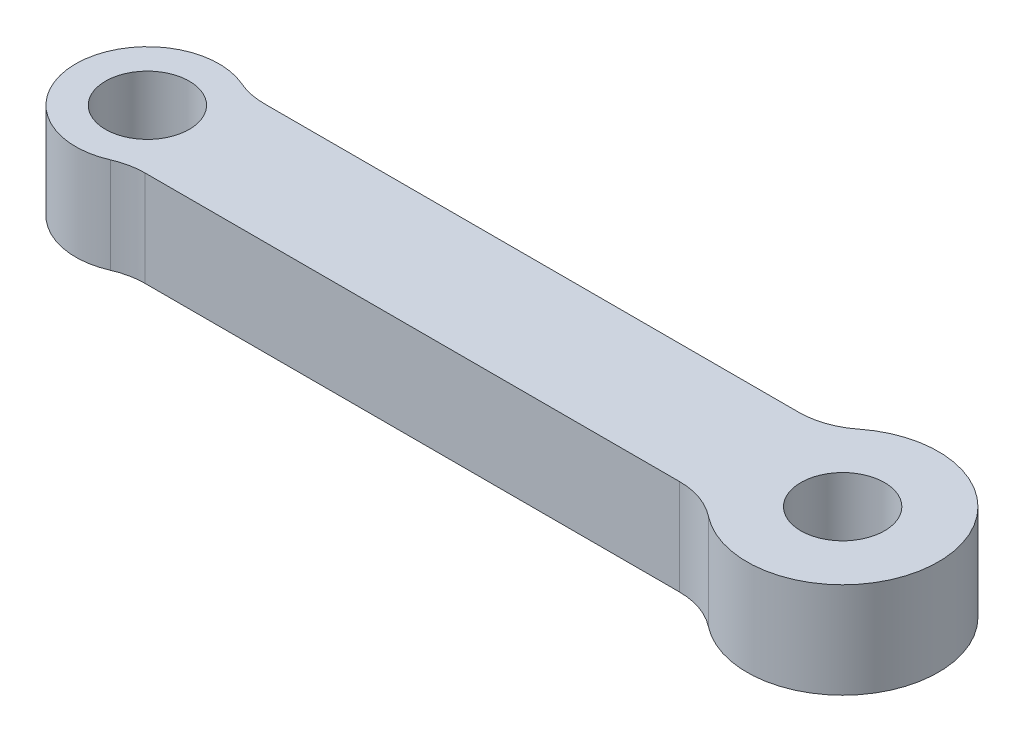
ISO-10303-21;
HEADER;
FILE_DESCRIPTION(('STEP AP214'),'2;1');
FILE_NAME('part.step','',(''),(''),'','','');
FILE_SCHEMA(('AUTOMOTIVE_DESIGN { 1 0 10303 214 1 1 1 1 }'));
ENDSEC;
DATA;
#1=APPLICATION_CONTEXT('core data for automotive mechanical design processes');
#2=APPLICATION_PROTOCOL_DEFINITION('international standard','automotive_design',2000,#1);
#3=PRODUCT_CONTEXT('',#1,'mechanical');
#4=PRODUCT('Part','Part','',(#3));
#5=PRODUCT_RELATED_PRODUCT_CATEGORY('part','',(#4));
#6=PRODUCT_DEFINITION_FORMATION('','',#4);
#7=PRODUCT_DEFINITION_CONTEXT('part definition',#1,'design');
#8=PRODUCT_DEFINITION('design','',#6,#7);
#9=PRODUCT_DEFINITION_SHAPE('','',#8);
#10=(LENGTH_UNIT() NAMED_UNIT(*) SI_UNIT(.MILLI.,.METRE.));
#11=(NAMED_UNIT(*) PLANE_ANGLE_UNIT() SI_UNIT($,.RADIAN.));
#12=(NAMED_UNIT(*) SI_UNIT($,.STERADIAN.) SOLID_ANGLE_UNIT());
#13=UNCERTAINTY_MEASURE_WITH_UNIT(LENGTH_MEASURE(1.E-05),#10,'distance_accuracy_value','');
#14=(GEOMETRIC_REPRESENTATION_CONTEXT(3) GLOBAL_UNCERTAINTY_ASSIGNED_CONTEXT((#13)) GLOBAL_UNIT_ASSIGNED_CONTEXT((#10,
#11,#12)) REPRESENTATION_CONTEXT('',''));
#15=CARTESIAN_POINT('',(0.,0.,0.));
#16=DIRECTION('',(0.,0.,1.));
#17=DIRECTION('',(1.,0.,0.));
#18=AXIS2_PLACEMENT_3D('',#15,#16,#17);
#19=CARTESIAN_POINT('',(11.17,4.,5.5));
#20=DIRECTION('',(0.,-1.,0.));
#21=DIRECTION('',(0.,0.,-1.));
#22=AXIS2_PLACEMENT_3D('',#19,#20,#21);
#23=PLANE('',#22);
#24=CARTESIAN_POINT('',(-13.5679157616564,4.,0.));
#25=DIRECTION('',(0.,1.,0.));
#26=DIRECTION('',(0.,0.,1.));
#27=AXIS2_PLACEMENT_3D('',#24,#25,#26);
#28=CIRCLE('',#27,1.75);
#29=CARTESIAN_POINT('',(-13.5679157616564,4.,1.75));
#30=VERTEX_POINT('',#29);
#31=EDGE_CURVE('E135',#30,#30,#28,.T.);
#32=ORIENTED_EDGE('',*,*,#31,.F.);
#33=EDGE_LOOP('',(#32));
#34=FACE_BOUND('',#33,.T.);
#35=CARTESIAN_POINT('',(11.17,4.,5.5));
#36=DIRECTION('',(0.,-1.,0.));
#37=DIRECTION('',(0.,0.,-1.));
#38=AXIS2_PLACEMENT_3D('',#35,#36,#37);
#39=CIRCLE('',#38,3.);
#40=CARTESIAN_POINT('',(11.17,4.,2.5));
#41=VERTEX_POINT('',#40);
#42=CARTESIAN_POINT('',(13.0257687223952,4.,3.14285714285714));
#43=VERTEX_POINT('',#42);
#44=EDGE_CURVE('E148',#41,#43,#39,.T.);
#45=ORIENTED_EDGE('',*,*,#44,.T.);
#46=CARTESIAN_POINT('',(15.5001270189222,4.,0.));
#47=DIRECTION('',(0.,1.,0.));
#48=DIRECTION('',(0.,0.,1.));
#49=AXIS2_PLACEMENT_3D('',#46,#47,#48);
#50=CIRCLE('',#49,4.);
#51=CARTESIAN_POINT('',(13.0257687223952,4.,-3.14285714285714));
#52=VERTEX_POINT('',#51);
#53=EDGE_CURVE('E91',#43,#52,#50,.T.);
#54=ORIENTED_EDGE('',*,*,#53,.T.);
#55=CARTESIAN_POINT('',(11.17,4.,-5.5));
#56=DIRECTION('',(0.,-1.,0.));
#57=DIRECTION('',(0.,0.,1.));
#58=AXIS2_PLACEMENT_3D('',#55,#56,#57);
#59=CIRCLE('',#58,3.);
#60=CARTESIAN_POINT('',(11.17,4.,-2.5));
#61=VERTEX_POINT('',#60);
#62=EDGE_CURVE('E163',#52,#61,#59,.T.);
#63=ORIENTED_EDGE('',*,*,#62,.T.);
#64=DIRECTION('',(-1.,0.,0.));
#65=VECTOR('',#64,1.);
#66=CARTESIAN_POINT('',(4.07110647886474,4.,-2.5));
#67=LINE('',#66,#65);
#68=CARTESIAN_POINT('',(-11.17,4.,-2.5));
#69=VERTEX_POINT('',#68);
#70=EDGE_CURVE('E173',#61,#69,#67,.T.);
#71=ORIENTED_EDGE('',*,*,#70,.T.);
#72=CARTESIAN_POINT('',(-11.17,4.,-5.5));
#73=DIRECTION('',(0.,-1.,0.));
#74=DIRECTION('',(0.,0.,-1.));
#75=AXIS2_PLACEMENT_3D('',#72,#73,#74);
#76=CIRCLE('',#75,3.);
#77=CARTESIAN_POINT('',(-12.3689578808282,4.,-2.75));
#78=VERTEX_POINT('',#77);
#79=EDGE_CURVE('E111',#69,#78,#76,.T.);
#80=ORIENTED_EDGE('',*,*,#79,.T.);
#81=CARTESIAN_POINT('',(-13.5679157616564,4.,0.));
#82=DIRECTION('',(0.,1.,0.));
#83=DIRECTION('',(0.,0.,1.));
#84=AXIS2_PLACEMENT_3D('',#81,#82,#83);
#85=CIRCLE('',#84,3.);
#86=CARTESIAN_POINT('',(-12.3689578808282,4.,2.75));
#87=VERTEX_POINT('',#86);
#88=EDGE_CURVE('E104',#78,#87,#85,.T.);
#89=ORIENTED_EDGE('',*,*,#88,.T.);
#90=CARTESIAN_POINT('',(-11.17,4.,5.5));
#91=DIRECTION('',(0.,-1.,0.));
#92=DIRECTION('',(0.,0.,-1.));
#93=AXIS2_PLACEMENT_3D('',#90,#91,#92);
#94=CIRCLE('',#93,3.);
#95=CARTESIAN_POINT('',(-11.17,4.,2.5));
#96=VERTEX_POINT('',#95);
#97=EDGE_CURVE('E108',#87,#96,#94,.T.);
#98=ORIENTED_EDGE('',*,*,#97,.T.);
#99=DIRECTION('',(1.,0.,0.));
#100=VECTOR('',#99,1.);
#101=CARTESIAN_POINT('',(-10.2186534112875,4.,2.5));
#102=LINE('',#101,#100);
#103=EDGE_CURVE('E50',#96,#41,#102,.T.);
#104=ORIENTED_EDGE('',*,*,#103,.T.);
#105=EDGE_LOOP('',(#45,#54,#63,#71,#80,#89,#98,#104));
#106=FACE_BOUND('',#105,.T.);
#107=CARTESIAN_POINT('',(15.5001270189222,4.,0.));
#108=DIRECTION('',(0.,1.,0.));
#109=DIRECTION('',(0.,0.,1.));
#110=AXIS2_PLACEMENT_3D('',#107,#108,#109);
#111=CIRCLE('',#110,1.75);
#112=CARTESIAN_POINT('',(15.5001270189222,4.,1.75));
#113=VERTEX_POINT('',#112);
#114=EDGE_CURVE('E182',#113,#113,#111,.T.);
#115=ORIENTED_EDGE('',*,*,#114,.F.);
#116=EDGE_LOOP('',(#115));
#117=FACE_BOUND('',#116,.T.);
#118=ADVANCED_FACE('F33',(#34,#106,#117),#23,.F.);
#119=CARTESIAN_POINT('',(11.17,0.,5.5));
#120=DIRECTION('',(0.,-1.,0.));
#121=DIRECTION('',(0.,0.,-1.));
#122=AXIS2_PLACEMENT_3D('',#119,#120,#121);
#123=PLANE('',#122);
#124=CARTESIAN_POINT('',(-13.5679157616564,0.,0.));
#125=DIRECTION('',(0.,1.,0.));
#126=DIRECTION('',(0.,0.,1.));
#127=AXIS2_PLACEMENT_3D('',#124,#125,#126);
#128=CIRCLE('',#127,1.75);
#129=CARTESIAN_POINT('',(-13.5679157616564,0.,1.75));
#130=VERTEX_POINT('',#129);
#131=EDGE_CURVE('E179',#130,#130,#128,.T.);
#132=ORIENTED_EDGE('',*,*,#131,.T.);
#133=EDGE_LOOP('',(#132));
#134=FACE_BOUND('',#133,.T.);
#135=CARTESIAN_POINT('',(11.17,0.,5.5));
#136=DIRECTION('',(0.,-1.,0.));
#137=DIRECTION('',(0.,0.,-1.));
#138=AXIS2_PLACEMENT_3D('',#135,#136,#137);
#139=CIRCLE('',#138,3.);
#140=CARTESIAN_POINT('',(11.17,0.,2.5));
#141=VERTEX_POINT('',#140);
#142=CARTESIAN_POINT('',(13.0257687223952,0.,3.14285714285714));
#143=VERTEX_POINT('',#142);
#144=EDGE_CURVE('E131',#141,#143,#139,.T.);
#145=ORIENTED_EDGE('',*,*,#144,.F.);
#146=DIRECTION('',(1.,0.,0.));
#147=VECTOR('',#146,1.);
#148=CARTESIAN_POINT('',(4.07110647886474,0.,2.5));
#149=LINE('',#148,#147);
#150=CARTESIAN_POINT('',(-11.17,0.,2.5));
#151=VERTEX_POINT('',#150);
#152=EDGE_CURVE('E79',#151,#141,#149,.T.);
#153=ORIENTED_EDGE('',*,*,#152,.F.);
#154=CARTESIAN_POINT('',(-11.17,0.,5.5));
#155=DIRECTION('',(0.,-1.,0.));
#156=DIRECTION('',(0.,0.,-1.));
#157=AXIS2_PLACEMENT_3D('',#154,#155,#156);
#158=CIRCLE('',#157,3.);
#159=CARTESIAN_POINT('',(-12.3689578808282,0.,2.75));
#160=VERTEX_POINT('',#159);
#161=EDGE_CURVE('E145',#160,#151,#158,.T.);
#162=ORIENTED_EDGE('',*,*,#161,.F.);
#163=CARTESIAN_POINT('',(-13.5679157616564,0.,0.));
#164=DIRECTION('',(0.,1.,0.));
#165=DIRECTION('',(0.,0.,1.));
#166=AXIS2_PLACEMENT_3D('',#163,#164,#165);
#167=CIRCLE('',#166,3.);
#168=CARTESIAN_POINT('',(-12.3689578808282,0.,-2.75));
#169=VERTEX_POINT('',#168);
#170=EDGE_CURVE('E120',#169,#160,#167,.T.);
#171=ORIENTED_EDGE('',*,*,#170,.F.);
#172=CARTESIAN_POINT('',(-11.17,0.,-5.5));
#173=DIRECTION('',(0.,-1.,0.));
#174=DIRECTION('',(0.,0.,-1.));
#175=AXIS2_PLACEMENT_3D('',#172,#173,#174);
#176=CIRCLE('',#175,3.);
#177=CARTESIAN_POINT('',(-11.17,0.,-2.5));
#178=VERTEX_POINT('',#177);
#179=EDGE_CURVE('E142',#178,#169,#176,.T.);
#180=ORIENTED_EDGE('',*,*,#179,.F.);
#181=DIRECTION('',(-1.,0.,0.));
#182=VECTOR('',#181,1.);
#183=CARTESIAN_POINT('',(-10.2186534112875,0.,-2.5));
#184=LINE('',#183,#182);
#185=CARTESIAN_POINT('',(11.17,0.,-2.5));
#186=VERTEX_POINT('',#185);
#187=EDGE_CURVE('E140',#186,#178,#184,.T.);
#188=ORIENTED_EDGE('',*,*,#187,.F.);
#189=CARTESIAN_POINT('',(11.17,0.,-5.5));
#190=DIRECTION('',(0.,-1.,0.));
#191=DIRECTION('',(0.,0.,1.));
#192=AXIS2_PLACEMENT_3D('',#189,#190,#191);
#193=CIRCLE('',#192,3.);
#194=CARTESIAN_POINT('',(13.0257687223952,0.,-3.14285714285714));
#195=VERTEX_POINT('',#194);
#196=EDGE_CURVE('E137',#195,#186,#193,.T.);
#197=ORIENTED_EDGE('',*,*,#196,.F.);
#198=CARTESIAN_POINT('',(15.5001270189222,0.,0.));
#199=DIRECTION('',(0.,1.,0.));
#200=DIRECTION('',(0.,0.,1.));
#201=AXIS2_PLACEMENT_3D('',#198,#199,#200);
#202=CIRCLE('',#201,4.);
#203=EDGE_CURVE('E134',#143,#195,#202,.T.);
#204=ORIENTED_EDGE('',*,*,#203,.F.);
#205=EDGE_LOOP('',(#145,#153,#162,#171,#180,#188,#197,#204));
#206=FACE_BOUND('',#205,.T.);
#207=CARTESIAN_POINT('',(15.5001270189222,0.,0.));
#208=DIRECTION('',(0.,1.,0.));
#209=DIRECTION('',(0.,0.,1.));
#210=AXIS2_PLACEMENT_3D('',#207,#208,#209);
#211=CIRCLE('',#210,1.75);
#212=CARTESIAN_POINT('',(15.5001270189222,0.,1.75));
#213=VERTEX_POINT('',#212);
#214=EDGE_CURVE('E185',#213,#213,#211,.T.);
#215=ORIENTED_EDGE('',*,*,#214,.T.);
#216=EDGE_LOOP('',(#215));
#217=FACE_BOUND('',#216,.T.);
#218=ADVANCED_FACE('F164',(#134,#206,#217),#123,.T.);
#219=CARTESIAN_POINT('',(11.17,4.,5.5));
#220=DIRECTION('',(0.,-1.,0.));
#221=DIRECTION('',(0.,0.,-1.));
#222=AXIS2_PLACEMENT_3D('',#219,#220,#221);
#223=CYLINDRICAL_SURFACE('',#222,3.);
#224=ORIENTED_EDGE('',*,*,#144,.T.);
#225=DIRECTION('',(0.,-1.,0.));
#226=VECTOR('',#225,1.);
#227=CARTESIAN_POINT('',(13.0257687223952,4.,3.14285714285714));
#228=LINE('',#227,#226);
#229=EDGE_CURVE('E11',#43,#143,#228,.T.);
#230=ORIENTED_EDGE('',*,*,#229,.F.);
#231=ORIENTED_EDGE('',*,*,#44,.F.);
#232=DIRECTION('',(0.,-1.,0.));
#233=VECTOR('',#232,1.);
#234=CARTESIAN_POINT('',(11.17,4.,2.5));
#235=LINE('',#234,#233);
#236=EDGE_CURVE('E127',#41,#141,#235,.T.);
#237=ORIENTED_EDGE('',*,*,#236,.T.);
#238=EDGE_LOOP('',(#224,#230,#231,#237));
#239=FACE_BOUND('',#238,.T.);
#240=ADVANCED_FACE('F35',(#239),#223,.F.);
#241=CARTESIAN_POINT('',(15.5001270189222,4.,0.));
#242=DIRECTION('',(0.,-1.,0.));
#243=DIRECTION('',(0.,0.,-1.));
#244=AXIS2_PLACEMENT_3D('',#241,#242,#243);
#245=CYLINDRICAL_SURFACE('',#244,4.);
#246=ORIENTED_EDGE('',*,*,#203,.T.);
#247=DIRECTION('',(0.,-1.,0.));
#248=VECTOR('',#247,1.);
#249=CARTESIAN_POINT('',(13.0257687223952,4.,-3.14285714285714));
#250=LINE('',#249,#248);
#251=EDGE_CURVE('E42',#52,#195,#250,.T.);
#252=ORIENTED_EDGE('',*,*,#251,.F.);
#253=ORIENTED_EDGE('',*,*,#53,.F.);
#254=ORIENTED_EDGE('',*,*,#229,.T.);
#255=EDGE_LOOP('',(#246,#252,#253,#254));
#256=FACE_BOUND('',#255,.T.);
#257=ADVANCED_FACE('F218',(#256),#245,.T.);
#258=CARTESIAN_POINT('',(11.17,4.,-5.5));
#259=DIRECTION('',(0.,-1.,0.));
#260=DIRECTION('',(0.,0.,-1.));
#261=AXIS2_PLACEMENT_3D('',#258,#259,#260);
#262=CYLINDRICAL_SURFACE('',#261,3.);
#263=ORIENTED_EDGE('',*,*,#196,.T.);
#264=DIRECTION('',(0.,-1.,0.));
#265=VECTOR('',#264,1.);
#266=CARTESIAN_POINT('',(11.17,4.,-2.5));
#267=LINE('',#266,#265);
#268=EDGE_CURVE('E155',#61,#186,#267,.T.);
#269=ORIENTED_EDGE('',*,*,#268,.F.);
#270=ORIENTED_EDGE('',*,*,#62,.F.);
#271=ORIENTED_EDGE('',*,*,#251,.T.);
#272=EDGE_LOOP('',(#263,#269,#270,#271));
#273=FACE_BOUND('',#272,.T.);
#274=ADVANCED_FACE('F161',(#273),#262,.F.);
#275=CARTESIAN_POINT('',(-10.2186534112875,4.,-2.5));
#276=DIRECTION('',(0.,0.,1.));
#277=DIRECTION('',(1.,0.,0.));
#278=AXIS2_PLACEMENT_3D('',#275,#276,#277);
#279=PLANE('',#278);
#280=ORIENTED_EDGE('',*,*,#187,.T.);
#281=DIRECTION('',(0.,-1.,0.));
#282=VECTOR('',#281,1.);
#283=CARTESIAN_POINT('',(-11.17,4.,-2.5));
#284=LINE('',#283,#282);
#285=EDGE_CURVE('E152',#69,#178,#284,.T.);
#286=ORIENTED_EDGE('',*,*,#285,.F.);
#287=ORIENTED_EDGE('',*,*,#70,.F.);
#288=ORIENTED_EDGE('',*,*,#268,.T.);
#289=EDGE_LOOP('',(#280,#286,#287,#288));
#290=FACE_BOUND('',#289,.T.);
#291=ADVANCED_FACE('F169',(#290),#279,.F.);
#292=CARTESIAN_POINT('',(-11.17,4.,-5.5));
#293=DIRECTION('',(0.,-1.,0.));
#294=DIRECTION('',(0.,0.,-1.));
#295=AXIS2_PLACEMENT_3D('',#292,#293,#294);
#296=CYLINDRICAL_SURFACE('',#295,3.);
#297=ORIENTED_EDGE('',*,*,#179,.T.);
#298=DIRECTION('',(0.,-1.,0.));
#299=VECTOR('',#298,1.);
#300=CARTESIAN_POINT('',(-12.3689578808282,4.,-2.75));
#301=LINE('',#300,#299);
#302=EDGE_CURVE('E122',#78,#169,#301,.T.);
#303=ORIENTED_EDGE('',*,*,#302,.F.);
#304=ORIENTED_EDGE('',*,*,#79,.F.);
#305=ORIENTED_EDGE('',*,*,#285,.T.);
#306=EDGE_LOOP('',(#297,#303,#304,#305));
#307=FACE_BOUND('',#306,.T.);
#308=ADVANCED_FACE('F172',(#307),#296,.F.);
#309=CARTESIAN_POINT('',(-13.5679157616564,4.,0.));
#310=DIRECTION('',(0.,-1.,0.));
#311=DIRECTION('',(0.,0.,-1.));
#312=AXIS2_PLACEMENT_3D('',#309,#310,#311);
#313=CYLINDRICAL_SURFACE('',#312,3.);
#314=ORIENTED_EDGE('',*,*,#170,.T.);
#315=DIRECTION('',(0.,-1.,0.));
#316=VECTOR('',#315,1.);
#317=CARTESIAN_POINT('',(-12.3689578808282,4.,2.75));
#318=LINE('',#317,#316);
#319=EDGE_CURVE('E117',#87,#160,#318,.T.);
#320=ORIENTED_EDGE('',*,*,#319,.F.);
#321=ORIENTED_EDGE('',*,*,#88,.F.);
#322=ORIENTED_EDGE('',*,*,#302,.T.);
#323=EDGE_LOOP('',(#314,#320,#321,#322));
#324=FACE_BOUND('',#323,.T.);
#325=ADVANCED_FACE('F118',(#324),#313,.T.);
#326=CARTESIAN_POINT('',(-11.17,4.,5.5));
#327=DIRECTION('',(0.,-1.,0.));
#328=DIRECTION('',(0.,0.,-1.));
#329=AXIS2_PLACEMENT_3D('',#326,#327,#328);
#330=CYLINDRICAL_SURFACE('',#329,3.);
#331=ORIENTED_EDGE('',*,*,#161,.T.);
#332=DIRECTION('',(0.,-1.,0.));
#333=VECTOR('',#332,1.);
#334=CARTESIAN_POINT('',(-11.17,4.,2.5));
#335=LINE('',#334,#333);
#336=EDGE_CURVE('E123',#96,#151,#335,.T.);
#337=ORIENTED_EDGE('',*,*,#336,.F.);
#338=ORIENTED_EDGE('',*,*,#97,.F.);
#339=ORIENTED_EDGE('',*,*,#319,.T.);
#340=EDGE_LOOP('',(#331,#337,#338,#339));
#341=FACE_BOUND('',#340,.T.);
#342=ADVANCED_FACE('F125',(#341),#330,.F.);
#343=CARTESIAN_POINT('',(4.07110647886474,4.,2.5));
#344=DIRECTION('',(0.,0.,-1.));
#345=DIRECTION('',(-1.,0.,0.));
#346=AXIS2_PLACEMENT_3D('',#343,#344,#345);
#347=PLANE('',#346);
#348=ORIENTED_EDGE('',*,*,#152,.T.);
#349=ORIENTED_EDGE('',*,*,#236,.F.);
#350=ORIENTED_EDGE('',*,*,#103,.F.);
#351=ORIENTED_EDGE('',*,*,#336,.T.);
#352=EDGE_LOOP('',(#348,#349,#350,#351));
#353=FACE_BOUND('',#352,.T.);
#354=ADVANCED_FACE('F206',(#353),#347,.F.);
#355=CARTESIAN_POINT('',(-13.5679157616564,4.,0.));
#356=DIRECTION('',(0.,-1.,0.));
#357=DIRECTION('',(0.,0.,-1.));
#358=AXIS2_PLACEMENT_3D('',#355,#356,#357);
#359=CYLINDRICAL_SURFACE('',#358,1.75);
#360=ORIENTED_EDGE('',*,*,#31,.T.);
#361=EDGE_LOOP('',(#360));
#362=FACE_BOUND('',#361,.T.);
#363=ORIENTED_EDGE('',*,*,#131,.F.);
#364=EDGE_LOOP('',(#363));
#365=FACE_BOUND('',#364,.T.);
#366=ADVANCED_FACE('F203',(#362,#365),#359,.F.);
#367=CARTESIAN_POINT('',(15.5001270189222,4.,0.));
#368=DIRECTION('',(0.,-1.,0.));
#369=DIRECTION('',(0.,0.,-1.));
#370=AXIS2_PLACEMENT_3D('',#367,#368,#369);
#371=CYLINDRICAL_SURFACE('',#370,1.75);
#372=ORIENTED_EDGE('',*,*,#114,.T.);
#373=EDGE_LOOP('',(#372));
#374=FACE_BOUND('',#373,.T.);
#375=ORIENTED_EDGE('',*,*,#214,.F.);
#376=EDGE_LOOP('',(#375));
#377=FACE_BOUND('',#376,.T.);
#378=ADVANCED_FACE('F191',(#374,#377),#371,.F.);
#379=CLOSED_SHELL('',(#118,#218,#240,#257,#274,#291,#308,#325,#342,#354,#366,#378));
#380=MANIFOLD_SOLID_BREP('B2',#379);
#381=ADVANCED_BREP_SHAPE_REPRESENTATION('',(#18,#380),#14);
#382=SHAPE_DEFINITION_REPRESENTATION(#9,#381);
ENDSEC;
END-ISO-10303-21;
